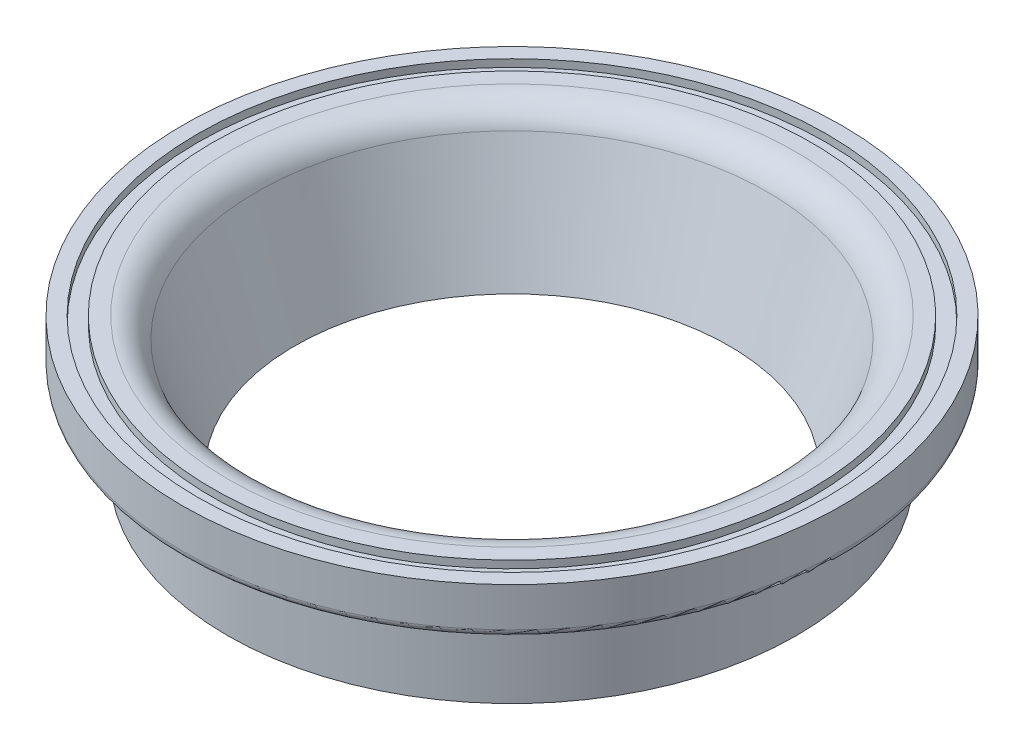
ISO-10303-21;
HEADER;
FILE_DESCRIPTION(('STEP AP214'),'2;1');
FILE_NAME('part.step','',(''),(''),'','','');
FILE_SCHEMA(('AUTOMOTIVE_DESIGN { 1 0 10303 214 1 1 1 1 }'));
ENDSEC;
DATA;
#1=APPLICATION_CONTEXT('core data for automotive mechanical design processes');
#2=APPLICATION_PROTOCOL_DEFINITION('international standard','automotive_design',2000,#1);
#3=PRODUCT_CONTEXT('',#1,'mechanical');
#4=PRODUCT('Part','Part','',(#3));
#5=PRODUCT_RELATED_PRODUCT_CATEGORY('part','',(#4));
#6=PRODUCT_DEFINITION_FORMATION('','',#4);
#7=PRODUCT_DEFINITION_CONTEXT('part definition',#1,'design');
#8=PRODUCT_DEFINITION('design','',#6,#7);
#9=PRODUCT_DEFINITION_SHAPE('','',#8);
#10=(LENGTH_UNIT() NAMED_UNIT(*) SI_UNIT(.MILLI.,.METRE.));
#11=(NAMED_UNIT(*) PLANE_ANGLE_UNIT() SI_UNIT($,.RADIAN.));
#12=(NAMED_UNIT(*) SI_UNIT($,.STERADIAN.) SOLID_ANGLE_UNIT());
#13=UNCERTAINTY_MEASURE_WITH_UNIT(LENGTH_MEASURE(1.E-05),#10,'distance_accuracy_value','');
#14=(GEOMETRIC_REPRESENTATION_CONTEXT(3) GLOBAL_UNCERTAINTY_ASSIGNED_CONTEXT((#13)) GLOBAL_UNIT_ASSIGNED_CONTEXT((#10,
#11,#12)) REPRESENTATION_CONTEXT('',''));
#15=CARTESIAN_POINT('',(0.,0.,0.));
#16=DIRECTION('',(0.,0.,1.));
#17=DIRECTION('',(1.,0.,0.));
#18=AXIS2_PLACEMENT_3D('',#15,#16,#17);
#19=CARTESIAN_POINT('',(0.,0.,-14.5));
#20=DIRECTION('',(0.,-1.,0.));
#21=DIRECTION('',(0.,0.,-1.));
#22=AXIS2_PLACEMENT_3D('',#19,#20,#21);
#23=PLANE('',#22);
#24=CARTESIAN_POINT('',(0.,0.,0.));
#25=DIRECTION('',(0.,-1.,0.));
#26=DIRECTION('',(1.,0.,0.));
#27=AXIS2_PLACEMENT_3D('',#24,#25,#26);
#28=CIRCLE('',#27,14.5);
#29=CARTESIAN_POINT('',(0.,0.,14.5));
#30=VERTEX_POINT('',#29);
#31=EDGE_CURVE('E159',#30,#30,#28,.T.);
#32=ORIENTED_EDGE('',*,*,#31,.F.);
#33=EDGE_LOOP('',(#32));
#34=FACE_BOUND('',#33,.T.);
#35=CARTESIAN_POINT('',(0.,0.,0.));
#36=DIRECTION('',(0.,-1.,0.));
#37=DIRECTION('',(1.,0.,0.));
#38=AXIS2_PLACEMENT_3D('',#35,#36,#37);
#39=CIRCLE('',#38,19.);
#40=CARTESIAN_POINT('',(0.,0.,19.));
#41=VERTEX_POINT('',#40);
#42=EDGE_CURVE('E30',#41,#41,#39,.T.);
#43=ORIENTED_EDGE('',*,*,#42,.T.);
#44=EDGE_LOOP('',(#43));
#45=FACE_BOUND('',#44,.T.);
#46=ADVANCED_FACE('F19',(#34,#45),#23,.T.);
#47=CARTESIAN_POINT('',(0.,2.69158072660957,0.));
#48=DIRECTION('',(0.,-1.,0.));
#49=DIRECTION('',(0.,0.,-1.));
#50=AXIS2_PLACEMENT_3D('',#47,#48,#49);
#51=CYLINDRICAL_SURFACE('',#50,19.);
#52=ORIENTED_EDGE('',*,*,#42,.F.);
#53=DIRECTION('',(0.,1.,0.));
#54=VECTOR('',#53,1.);
#55=CARTESIAN_POINT('',(0.,2.69158072660957,19.));
#56=LINE('',#55,#54);
#57=CARTESIAN_POINT('',(0.,5.38316145321914,19.));
#58=VERTEX_POINT('',#57);
#59=EDGE_CURVE('E11',#41,#58,#56,.T.);
#60=ORIENTED_EDGE('',*,*,#59,.T.);
#61=CARTESIAN_POINT('',(0.,5.38316145321914,0.));
#62=DIRECTION('',(0.,-1.,0.));
#63=DIRECTION('',(1.,0.,0.));
#64=AXIS2_PLACEMENT_3D('',#61,#62,#63);
#65=CIRCLE('',#64,19.);
#66=EDGE_CURVE('E137',#58,#58,#65,.T.);
#67=ORIENTED_EDGE('',*,*,#66,.T.);
#68=ORIENTED_EDGE('',*,*,#59,.F.);
#69=EDGE_LOOP('',(#52,#60,#67,#68));
#70=FACE_BOUND('',#69,.T.);
#71=ADVANCED_FACE('F199',(#70),#51,.T.);
#72=CARTESIAN_POINT('',(0.,5.38316145321914,0.));
#73=DIRECTION('',(0.,-1.,0.));
#74=DIRECTION('',(0.,0.,-1.));
#75=AXIS2_PLACEMENT_3D('',#72,#73,#74);
#76=TOROIDAL_SURFACE('',#75,19.5,0.5);
#77=CARTESIAN_POINT('',(0.,5.88316145321914,0.));
#78=DIRECTION('',(0.,-1.,0.));
#79=DIRECTION('',(1.,0.,0.));
#80=AXIS2_PLACEMENT_3D('',#77,#78,#79);
#81=CIRCLE('',#80,19.5);
#82=CARTESIAN_POINT('',(0.,5.88316145321914,19.5));
#83=VERTEX_POINT('',#82);
#84=EDGE_CURVE('E129',#83,#83,#81,.T.);
#85=ORIENTED_EDGE('',*,*,#84,.T.);
#86=CARTESIAN_POINT('',(0.,5.38316145321914,19.5));
#87=DIRECTION('',(-1.,0.,0.));
#88=DIRECTION('',(0.,0.,1.));
#89=AXIS2_PLACEMENT_3D('',#86,#87,#88);
#90=CIRCLE('',#89,0.5);
#91=EDGE_CURVE('E132',#83,#58,#90,.T.);
#92=ORIENTED_EDGE('',*,*,#91,.T.);
#93=ORIENTED_EDGE('',*,*,#66,.F.);
#94=ORIENTED_EDGE('',*,*,#91,.F.);
#95=EDGE_LOOP('',(#85,#92,#93,#94));
#96=FACE_BOUND('',#95,.T.);
#97=ADVANCED_FACE('F225',(#96),#76,.F.);
#98=CARTESIAN_POINT('',(0.,5.88316145321914,-19.5));
#99=DIRECTION('',(0.,-1.,0.));
#100=DIRECTION('',(0.,0.,-1.));
#101=AXIS2_PLACEMENT_3D('',#98,#99,#100);
#102=PLANE('',#101);
#103=ORIENTED_EDGE('',*,*,#84,.F.);
#104=EDGE_LOOP('',(#103));
#105=FACE_BOUND('',#104,.T.);
#106=CARTESIAN_POINT('',(0.,5.88316145321914,0.));
#107=DIRECTION('',(0.,-1.,0.));
#108=DIRECTION('',(1.,0.,0.));
#109=AXIS2_PLACEMENT_3D('',#106,#107,#108);
#110=CIRCLE('',#109,21.5);
#111=CARTESIAN_POINT('',(0.,5.88316145321914,21.5));
#112=VERTEX_POINT('',#111);
#113=EDGE_CURVE('E123',#112,#112,#110,.T.);
#114=ORIENTED_EDGE('',*,*,#113,.T.);
#115=EDGE_LOOP('',(#114));
#116=FACE_BOUND('',#115,.T.);
#117=ADVANCED_FACE('F219',(#105,#116),#102,.T.);
#118=CARTESIAN_POINT('',(0.,6.38316145321914,0.));
#119=DIRECTION('',(0.,-1.,0.));
#120=DIRECTION('',(0.,0.,-1.));
#121=AXIS2_PLACEMENT_3D('',#118,#119,#120);
#122=TOROIDAL_SURFACE('',#121,21.5,0.5);
#123=ORIENTED_EDGE('',*,*,#113,.F.);
#124=CARTESIAN_POINT('',(0.,6.38316145321914,21.5));
#125=DIRECTION('',(-1.,0.,0.));
#126=DIRECTION('',(0.,0.,1.));
#127=AXIS2_PLACEMENT_3D('',#124,#125,#126);
#128=CIRCLE('',#127,0.5);
#129=CARTESIAN_POINT('',(0.,6.38316145321914,22.));
#130=VERTEX_POINT('',#129);
#131=EDGE_CURVE('E127',#112,#130,#128,.T.);
#132=ORIENTED_EDGE('',*,*,#131,.T.);
#133=CARTESIAN_POINT('',(0.,6.38316145321914,0.));
#134=DIRECTION('',(0.,-1.,0.));
#135=DIRECTION('',(1.,0.,0.));
#136=AXIS2_PLACEMENT_3D('',#133,#134,#135);
#137=CIRCLE('',#136,22.);
#138=EDGE_CURVE('E116',#130,#130,#137,.T.);
#139=ORIENTED_EDGE('',*,*,#138,.T.);
#140=ORIENTED_EDGE('',*,*,#131,.F.);
#141=EDGE_LOOP('',(#123,#132,#139,#140));
#142=FACE_BOUND('',#141,.T.);
#143=ADVANCED_FACE('F224',(#142),#122,.T.);
#144=CARTESIAN_POINT('',(0.,7.69158072660957,0.));
#145=DIRECTION('',(0.,-1.,0.));
#146=DIRECTION('',(0.,0.,-1.));
#147=AXIS2_PLACEMENT_3D('',#144,#145,#146);
#148=CYLINDRICAL_SURFACE('',#147,22.);
#149=ORIENTED_EDGE('',*,*,#138,.F.);
#150=DIRECTION('',(0.,1.,0.));
#151=VECTOR('',#150,1.);
#152=CARTESIAN_POINT('',(0.,7.69158072660957,22.));
#153=LINE('',#152,#151);
#154=CARTESIAN_POINT('',(0.,9.,22.));
#155=VERTEX_POINT('',#154);
#156=EDGE_CURVE('E128',#130,#155,#153,.T.);
#157=ORIENTED_EDGE('',*,*,#156,.T.);
#158=CARTESIAN_POINT('',(0.,9.,0.));
#159=DIRECTION('',(0.,-1.,0.));
#160=DIRECTION('',(1.,0.,0.));
#161=AXIS2_PLACEMENT_3D('',#158,#159,#160);
#162=CIRCLE('',#161,22.);
#163=EDGE_CURVE('E108',#155,#155,#162,.T.);
#164=ORIENTED_EDGE('',*,*,#163,.T.);
#165=ORIENTED_EDGE('',*,*,#156,.F.);
#166=EDGE_LOOP('',(#149,#157,#164,#165));
#167=FACE_BOUND('',#166,.T.);
#168=ADVANCED_FACE('F251',(#167),#148,.T.);
#169=CARTESIAN_POINT('',(0.,9.,-22.));
#170=DIRECTION('',(0.,1.,0.));
#171=DIRECTION('',(1.,0.,0.));
#172=AXIS2_PLACEMENT_3D('',#169,#170,#171);
#173=PLANE('',#172);
#174=CARTESIAN_POINT('',(0.,9.,0.));
#175=DIRECTION('',(0.,-1.,0.));
#176=DIRECTION('',(1.,0.,0.));
#177=AXIS2_PLACEMENT_3D('',#174,#175,#176);
#178=CIRCLE('',#177,21.);
#179=CARTESIAN_POINT('',(-21.,9.,0.));
#180=VERTEX_POINT('',#179);
#181=EDGE_CURVE('E118',#180,#180,#178,.T.);
#182=ORIENTED_EDGE('',*,*,#181,.T.);
#183=EDGE_LOOP('',(#182));
#184=FACE_BOUND('',#183,.T.);
#185=ORIENTED_EDGE('',*,*,#163,.F.);
#186=EDGE_LOOP('',(#185));
#187=FACE_BOUND('',#186,.T.);
#188=ADVANCED_FACE('F245',(#184,#187),#173,.T.);
#189=CARTESIAN_POINT('',(0.,8.5,0.));
#190=DIRECTION('',(0.,1.,0.));
#191=DIRECTION('',(1.,0.,0.));
#192=AXIS2_PLACEMENT_3D('',#189,#190,#191);
#193=PLANE('',#192);
#194=CARTESIAN_POINT('',(0.,8.5,0.));
#195=DIRECTION('',(0.,1.,0.));
#196=DIRECTION('',(-1.,0.,0.));
#197=AXIS2_PLACEMENT_3D('',#194,#195,#196);
#198=CIRCLE('',#197,20.);
#199=CARTESIAN_POINT('',(20.,8.5,0.));
#200=VERTEX_POINT('',#199);
#201=EDGE_CURVE('E136',#200,#200,#198,.T.);
#202=ORIENTED_EDGE('',*,*,#201,.F.);
#203=EDGE_LOOP('',(#202));
#204=FACE_BOUND('',#203,.T.);
#205=CARTESIAN_POINT('',(0.,8.5,0.));
#206=DIRECTION('',(0.,-1.,0.));
#207=DIRECTION('',(1.,0.,0.));
#208=AXIS2_PLACEMENT_3D('',#205,#206,#207);
#209=CIRCLE('',#208,21.);
#210=CARTESIAN_POINT('',(-21.,8.5,0.));
#211=VERTEX_POINT('',#210);
#212=EDGE_CURVE('E104',#211,#211,#209,.T.);
#213=ORIENTED_EDGE('',*,*,#212,.F.);
#214=EDGE_LOOP('',(#213));
#215=FACE_BOUND('',#214,.T.);
#216=ADVANCED_FACE('F250',(#204,#215),#193,.T.);
#217=CARTESIAN_POINT('',(0.,9.,0.));
#218=DIRECTION('',(0.,-1.,0.));
#219=DIRECTION('',(1.,0.,0.));
#220=AXIS2_PLACEMENT_3D('',#217,#218,#219);
#221=CYLINDRICAL_SURFACE('',#220,21.);
#222=ORIENTED_EDGE('',*,*,#181,.F.);
#223=DIRECTION('',(0.,-1.,0.));
#224=VECTOR('',#223,1.);
#225=CARTESIAN_POINT('',(-21.,9.,0.));
#226=LINE('',#225,#224);
#227=EDGE_CURVE('E99',#180,#211,#226,.T.);
#228=ORIENTED_EDGE('',*,*,#227,.T.);
#229=ORIENTED_EDGE('',*,*,#212,.T.);
#230=ORIENTED_EDGE('',*,*,#227,.F.);
#231=EDGE_LOOP('',(#222,#228,#229,#230));
#232=FACE_BOUND('',#231,.T.);
#233=ADVANCED_FACE('F105',(#232),#221,.F.);
#234=CARTESIAN_POINT('',(0.,9.,0.));
#235=DIRECTION('',(0.,-1.,0.));
#236=DIRECTION('',(-1.,0.,0.));
#237=AXIS2_PLACEMENT_3D('',#234,#235,#236);
#238=CYLINDRICAL_SURFACE('',#237,20.);
#239=CARTESIAN_POINT('',(0.,9.,0.));
#240=DIRECTION('',(0.,1.,0.));
#241=DIRECTION('',(-1.,0.,0.));
#242=AXIS2_PLACEMENT_3D('',#239,#240,#241);
#243=CIRCLE('',#242,20.);
#244=CARTESIAN_POINT('',(20.,9.,0.));
#245=VERTEX_POINT('',#244);
#246=EDGE_CURVE('E151',#245,#245,#243,.T.);
#247=ORIENTED_EDGE('',*,*,#246,.F.);
#248=DIRECTION('',(0.,-1.,0.));
#249=VECTOR('',#248,1.);
#250=CARTESIAN_POINT('',(20.,9.,0.));
#251=LINE('',#250,#249);
#252=EDGE_CURVE('E23',#245,#200,#251,.T.);
#253=ORIENTED_EDGE('',*,*,#252,.T.);
#254=ORIENTED_EDGE('',*,*,#201,.T.);
#255=ORIENTED_EDGE('',*,*,#252,.F.);
#256=EDGE_LOOP('',(#247,#253,#254,#255));
#257=FACE_BOUND('',#256,.T.);
#258=ADVANCED_FACE('F169',(#257),#238,.T.);
#259=CARTESIAN_POINT('',(0.,4.5,0.));
#260=DIRECTION('',(0.,1.,0.));
#261=DIRECTION('',(0.,0.,-1.));
#262=AXIS2_PLACEMENT_3D('',#259,#260,#261);
#263=CONICAL_SURFACE('',#262,16.,0.321750554396642);
#264=ORIENTED_EDGE('',*,*,#31,.T.);
#265=DIRECTION('',(0.,0.948683298050514,0.316227766016837));
#266=VECTOR('',#265,1.);
#267=CARTESIAN_POINT('',(0.,4.5,16.));
#268=LINE('',#267,#266);
#269=CARTESIAN_POINT('',(0.,7.63245553203368,17.0441518440112));
#270=VERTEX_POINT('',#269);
#271=EDGE_CURVE('E73',#30,#270,#268,.T.);
#272=ORIENTED_EDGE('',*,*,#271,.T.);
#273=CARTESIAN_POINT('',(0.,7.63245553203368,0.));
#274=DIRECTION('',(0.,-1.,0.));
#275=DIRECTION('',(0.,0.,1.));
#276=AXIS2_PLACEMENT_3D('',#273,#274,#275);
#277=CIRCLE('',#276,17.0441518440112);
#278=EDGE_CURVE('E148',#270,#270,#277,.T.);
#279=ORIENTED_EDGE('',*,*,#278,.F.);
#280=ORIENTED_EDGE('',*,*,#271,.F.);
#281=EDGE_LOOP('',(#264,#272,#279,#280));
#282=FACE_BOUND('',#281,.T.);
#283=ADVANCED_FACE('F234',(#282),#263,.F.);
#284=CARTESIAN_POINT('',(0.,9.,-22.));
#285=DIRECTION('',(0.,1.,0.));
#286=DIRECTION('',(1.,0.,0.));
#287=AXIS2_PLACEMENT_3D('',#284,#285,#286);
#288=PLANE('',#287);
#289=CARTESIAN_POINT('',(0.,9.,0.));
#290=DIRECTION('',(0.,1.,0.));
#291=DIRECTION('',(0.,0.,1.));
#292=AXIS2_PLACEMENT_3D('',#289,#290,#291);
#293=CIRCLE('',#292,18.9415184401123);
#294=CARTESIAN_POINT('',(0.,9.,18.9415184401123));
#295=VERTEX_POINT('',#294);
#296=EDGE_CURVE('E152',#295,#295,#293,.T.);
#297=ORIENTED_EDGE('',*,*,#296,.F.);
#298=EDGE_LOOP('',(#297));
#299=FACE_BOUND('',#298,.T.);
#300=ORIENTED_EDGE('',*,*,#246,.T.);
#301=EDGE_LOOP('',(#300));
#302=FACE_BOUND('',#301,.T.);
#303=ADVANCED_FACE('F21',(#299,#302),#288,.T.);
#304=CARTESIAN_POINT('',(0.,7.,0.));
#305=DIRECTION('',(0.,-1.,0.));
#306=DIRECTION('',(0.,0.,-1.));
#307=AXIS2_PLACEMENT_3D('',#304,#305,#306);
#308=TOROIDAL_SURFACE('',#307,18.9415184401123,2.);
#309=ORIENTED_EDGE('',*,*,#296,.T.);
#310=CARTESIAN_POINT('',(0.,7.,18.9415184401123));
#311=DIRECTION('',(-1.,0.,0.));
#312=DIRECTION('',(0.,0.,1.));
#313=AXIS2_PLACEMENT_3D('',#310,#311,#312);
#314=CIRCLE('',#313,2.);
#315=EDGE_CURVE('E84',#295,#270,#314,.T.);
#316=ORIENTED_EDGE('',*,*,#315,.T.);
#317=ORIENTED_EDGE('',*,*,#278,.T.);
#318=ORIENTED_EDGE('',*,*,#315,.F.);
#319=EDGE_LOOP('',(#309,#316,#317,#318));
#320=FACE_BOUND('',#319,.T.);
#321=ADVANCED_FACE('F208',(#320),#308,.T.);
#322=CLOSED_SHELL('',(#46,#71,#97,#117,#143,#168,#188,#216,#233,#258,#283,#303,#321));
#323=MANIFOLD_SOLID_BREP('B1',#322);
#324=ADVANCED_BREP_SHAPE_REPRESENTATION('',(#18,#323),#14);
#325=SHAPE_DEFINITION_REPRESENTATION(#9,#324);
ENDSEC;
END-ISO-10303-21;
